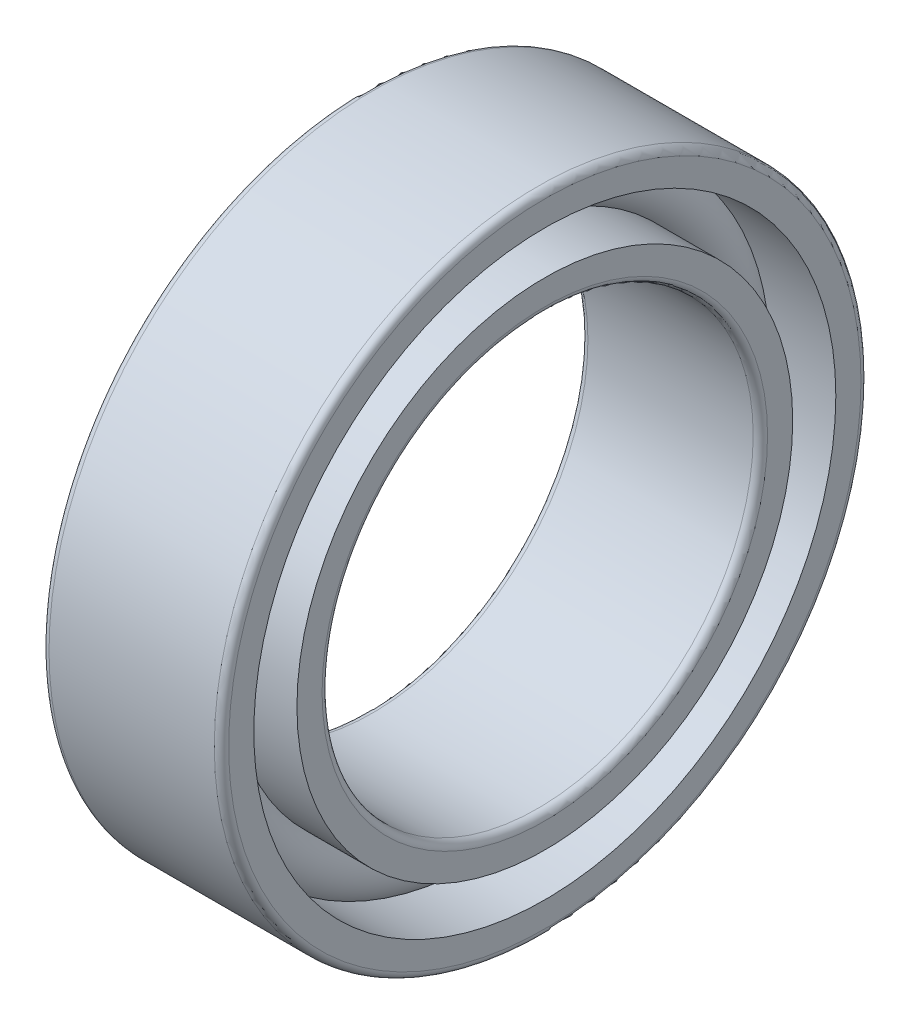
ISO-10303-21;
HEADER;
FILE_DESCRIPTION(('STEP AP214'),'2;1');
FILE_NAME('part.step','',(''),(''),'','','');
FILE_SCHEMA(('AUTOMOTIVE_DESIGN { 1 0 10303 214 1 1 1 1 }'));
ENDSEC;
DATA;
#1=APPLICATION_CONTEXT('core data for automotive mechanical design processes');
#2=APPLICATION_PROTOCOL_DEFINITION('international standard','automotive_design',2000,#1);
#3=PRODUCT_CONTEXT('',#1,'mechanical');
#4=PRODUCT('Part','Part','',(#3));
#5=PRODUCT_RELATED_PRODUCT_CATEGORY('part','',(#4));
#6=PRODUCT_DEFINITION_FORMATION('','',#4);
#7=PRODUCT_DEFINITION_CONTEXT('part definition',#1,'design');
#8=PRODUCT_DEFINITION('design','',#6,#7);
#9=PRODUCT_DEFINITION_SHAPE('','',#8);
#10=(LENGTH_UNIT() NAMED_UNIT(*) SI_UNIT(.MILLI.,.METRE.));
#11=(NAMED_UNIT(*) PLANE_ANGLE_UNIT() SI_UNIT($,.RADIAN.));
#12=(NAMED_UNIT(*) SI_UNIT($,.STERADIAN.) SOLID_ANGLE_UNIT());
#13=UNCERTAINTY_MEASURE_WITH_UNIT(LENGTH_MEASURE(1.E-05),#10,'distance_accuracy_value','');
#14=(GEOMETRIC_REPRESENTATION_CONTEXT(3) GLOBAL_UNCERTAINTY_ASSIGNED_CONTEXT((#13)) GLOBAL_UNIT_ASSIGNED_CONTEXT((#10,
#11,#12)) REPRESENTATION_CONTEXT('',''));
#15=CARTESIAN_POINT('',(0.,0.,0.));
#16=DIRECTION('',(0.,0.,1.));
#17=DIRECTION('',(1.,0.,0.));
#18=AXIS2_PLACEMENT_3D('',#15,#16,#17);
#19=CARTESIAN_POINT('',(0.,0.,0.));
#20=DIRECTION('',(-1.,0.,0.));
#21=DIRECTION('',(0.,0.,1.));
#22=AXIS2_PLACEMENT_3D('',#19,#20,#21);
#23=TOROIDAL_SURFACE('',#22,7.5,0.9);
#24=CARTESIAN_POINT('',(0.670820393249931,0.,0.));
#25=DIRECTION('',(-1.,0.,0.));
#26=DIRECTION('',(0.,0.,1.));
#27=AXIS2_PLACEMENT_3D('',#24,#25,#26);
#28=CIRCLE('',#27,8.10000000000001);
#29=CARTESIAN_POINT('',(0.670820393249931,0.,8.10000000000001));
#30=VERTEX_POINT('',#29);
#31=EDGE_CURVE('E35',#30,#30,#28,.F.);
#32=ORIENTED_EDGE('',*,*,#31,.T.);
#33=EDGE_LOOP('',(#32));
#34=FACE_BOUND('',#33,.T.);
#35=CARTESIAN_POINT('',(0.670820393249937,0.,0.));
#36=DIRECTION('',(-1.,0.,0.));
#37=DIRECTION('',(0.,0.,1.));
#38=AXIS2_PLACEMENT_3D('',#35,#36,#37);
#39=CIRCLE('',#38,6.9);
#40=CARTESIAN_POINT('',(0.670820393249937,0.,6.9));
#41=VERTEX_POINT('',#40);
#42=EDGE_CURVE('E10',#41,#41,#39,.T.);
#43=ORIENTED_EDGE('',*,*,#42,.T.);
#44=EDGE_LOOP('',(#43));
#45=FACE_BOUND('',#44,.T.);
#46=ADVANCED_FACE('F31',(#34,#45),#23,.T.);
#47=CARTESIAN_POINT('',(-20.6375,0.,0.));
#48=DIRECTION('',(1.,0.,0.));
#49=DIRECTION('',(0.,0.,-1.));
#50=AXIS2_PLACEMENT_3D('',#47,#48,#49);
#51=CYLINDRICAL_SURFACE('',#50,6.9);
#52=CARTESIAN_POINT('',(2.5,0.,0.));
#53=DIRECTION('',(1.,0.,0.));
#54=DIRECTION('',(0.,0.,-1.));
#55=AXIS2_PLACEMENT_3D('',#52,#53,#54);
#56=CIRCLE('',#55,6.9);
#57=CARTESIAN_POINT('',(2.5,0.,-6.9));
#58=VERTEX_POINT('',#57);
#59=EDGE_CURVE('E44',#58,#58,#56,.T.);
#60=ORIENTED_EDGE('',*,*,#59,.F.);
#61=EDGE_LOOP('',(#60));
#62=FACE_BOUND('',#61,.T.);
#63=ORIENTED_EDGE('',*,*,#42,.F.);
#64=EDGE_LOOP('',(#63));
#65=FACE_BOUND('',#64,.T.);
#66=ADVANCED_FACE('F83',(#62,#65),#51,.T.);
#67=CARTESIAN_POINT('',(-20.6375,0.,0.));
#68=DIRECTION('',(1.,0.,0.));
#69=DIRECTION('',(0.,0.,-1.));
#70=AXIS2_PLACEMENT_3D('',#67,#68,#69);
#71=CYLINDRICAL_SURFACE('',#70,6.9);
#72=CARTESIAN_POINT('',(-2.5,0.,0.));
#73=DIRECTION('',(1.,0.,0.));
#74=DIRECTION('',(0.,0.,-1.));
#75=AXIS2_PLACEMENT_3D('',#72,#73,#74);
#76=CIRCLE('',#75,6.9);
#77=CARTESIAN_POINT('',(-2.5,0.,-6.9));
#78=VERTEX_POINT('',#77);
#79=EDGE_CURVE('E53',#78,#78,#76,.T.);
#80=ORIENTED_EDGE('',*,*,#79,.T.);
#81=EDGE_LOOP('',(#80));
#82=FACE_BOUND('',#81,.T.);
#83=CARTESIAN_POINT('',(-0.670820393249937,0.,0.));
#84=DIRECTION('',(1.,0.,0.));
#85=DIRECTION('',(0.,0.,-1.));
#86=AXIS2_PLACEMENT_3D('',#83,#84,#85);
#87=CIRCLE('',#86,6.9);
#88=CARTESIAN_POINT('',(-0.670820393249937,0.,-6.9));
#89=VERTEX_POINT('',#88);
#90=EDGE_CURVE('E39',#89,#89,#87,.T.);
#91=ORIENTED_EDGE('',*,*,#90,.F.);
#92=EDGE_LOOP('',(#91));
#93=FACE_BOUND('',#92,.T.);
#94=ADVANCED_FACE('F86',(#82,#93),#71,.T.);
#95=CARTESIAN_POINT('',(2.5,6.2,0.));
#96=DIRECTION('',(1.,0.,0.));
#97=DIRECTION('',(0.,0.,-1.));
#98=AXIS2_PLACEMENT_3D('',#95,#96,#97);
#99=PLANE('',#98);
#100=ORIENTED_EDGE('',*,*,#59,.T.);
#101=EDGE_LOOP('',(#100));
#102=FACE_BOUND('',#101,.T.);
#103=CARTESIAN_POINT('',(2.5,0.,0.));
#104=DIRECTION('',(1.,0.,0.));
#105=DIRECTION('',(0.,0.,-1.));
#106=AXIS2_PLACEMENT_3D('',#103,#104,#105);
#107=CIRCLE('',#106,6.2);
#108=CARTESIAN_POINT('',(2.5,0.,-6.2));
#109=VERTEX_POINT('',#108);
#110=EDGE_CURVE('E75',#109,#109,#107,.T.);
#111=ORIENTED_EDGE('',*,*,#110,.F.);
#112=EDGE_LOOP('',(#111));
#113=FACE_BOUND('',#112,.T.);
#114=ADVANCED_FACE('F80',(#102,#113),#99,.T.);
#115=CARTESIAN_POINT('',(2.3,0.,0.));
#116=DIRECTION('',(1.,0.,0.));
#117=DIRECTION('',(0.,0.,-1.));
#118=AXIS2_PLACEMENT_3D('',#115,#116,#117);
#119=TOROIDAL_SURFACE('',#118,6.2,0.2);
#120=ORIENTED_EDGE('',*,*,#110,.T.);
#121=EDGE_LOOP('',(#120));
#122=FACE_BOUND('',#121,.T.);
#123=CARTESIAN_POINT('',(2.3,0.,0.));
#124=DIRECTION('',(1.,0.,0.));
#125=DIRECTION('',(0.,0.,-1.));
#126=AXIS2_PLACEMENT_3D('',#123,#124,#125);
#127=CIRCLE('',#126,6.);
#128=CARTESIAN_POINT('',(2.3,0.,-6.));
#129=VERTEX_POINT('',#128);
#130=EDGE_CURVE('E72',#129,#129,#127,.T.);
#131=ORIENTED_EDGE('',*,*,#130,.F.);
#132=EDGE_LOOP('',(#131));
#133=FACE_BOUND('',#132,.T.);
#134=ADVANCED_FACE('F97',(#122,#133),#119,.T.);
#135=CARTESIAN_POINT('',(-20.6375,0.,0.));
#136=DIRECTION('',(1.,0.,0.));
#137=DIRECTION('',(0.,0.,-1.));
#138=AXIS2_PLACEMENT_3D('',#135,#136,#137);
#139=CYLINDRICAL_SURFACE('',#138,6.);
#140=ORIENTED_EDGE('',*,*,#130,.T.);
#141=EDGE_LOOP('',(#140));
#142=FACE_BOUND('',#141,.T.);
#143=CARTESIAN_POINT('',(-2.3,0.,0.));
#144=DIRECTION('',(1.,0.,0.));
#145=DIRECTION('',(0.,0.,-1.));
#146=AXIS2_PLACEMENT_3D('',#143,#144,#145);
#147=CIRCLE('',#146,6.);
#148=CARTESIAN_POINT('',(-2.3,0.,-6.));
#149=VERTEX_POINT('',#148);
#150=EDGE_CURVE('E69',#149,#149,#147,.T.);
#151=ORIENTED_EDGE('',*,*,#150,.F.);
#152=EDGE_LOOP('',(#151));
#153=FACE_BOUND('',#152,.T.);
#154=ADVANCED_FACE('F100',(#142,#153),#139,.F.);
#155=CARTESIAN_POINT('',(-2.3,0.,0.));
#156=DIRECTION('',(1.,0.,0.));
#157=DIRECTION('',(0.,0.,-1.));
#158=AXIS2_PLACEMENT_3D('',#155,#156,#157);
#159=TOROIDAL_SURFACE('',#158,6.2,0.2);
#160=ORIENTED_EDGE('',*,*,#150,.T.);
#161=EDGE_LOOP('',(#160));
#162=FACE_BOUND('',#161,.T.);
#163=CARTESIAN_POINT('',(-2.5,0.,0.));
#164=DIRECTION('',(1.,0.,0.));
#165=DIRECTION('',(0.,0.,-1.));
#166=AXIS2_PLACEMENT_3D('',#163,#164,#165);
#167=CIRCLE('',#166,6.2);
#168=CARTESIAN_POINT('',(-2.5,0.,-6.2));
#169=VERTEX_POINT('',#168);
#170=EDGE_CURVE('E66',#169,#169,#167,.T.);
#171=ORIENTED_EDGE('',*,*,#170,.F.);
#172=EDGE_LOOP('',(#171));
#173=FACE_BOUND('',#172,.T.);
#174=ADVANCED_FACE('F104',(#162,#173),#159,.T.);
#175=CARTESIAN_POINT('',(-2.5,6.9,0.));
#176=DIRECTION('',(-1.,0.,0.));
#177=DIRECTION('',(0.,0.,1.));
#178=AXIS2_PLACEMENT_3D('',#175,#176,#177);
#179=PLANE('',#178);
#180=ORIENTED_EDGE('',*,*,#170,.T.);
#181=EDGE_LOOP('',(#180));
#182=FACE_BOUND('',#181,.T.);
#183=ORIENTED_EDGE('',*,*,#79,.F.);
#184=EDGE_LOOP('',(#183));
#185=FACE_BOUND('',#184,.T.);
#186=ADVANCED_FACE('F108',(#182,#185),#179,.T.);
#187=CARTESIAN_POINT('',(-0.670820393249931,0.,0.));
#188=DIRECTION('',(1.,0.,0.));
#189=DIRECTION('',(0.,0.,-1.));
#190=AXIS2_PLACEMENT_3D('',#187,#188,#189);
#191=CIRCLE('',#190,8.10000000000001);
#192=CARTESIAN_POINT('',(-0.670820393249931,0.,-8.10000000000001));
#193=VERTEX_POINT('',#192);
#194=EDGE_CURVE('E47',#193,#193,#191,.F.);
#195=ORIENTED_EDGE('',*,*,#194,.T.);
#196=EDGE_LOOP('',(#195));
#197=FACE_BOUND('',#196,.T.);
#198=ORIENTED_EDGE('',*,*,#90,.T.);
#199=EDGE_LOOP('',(#198));
#200=FACE_BOUND('',#199,.T.);
#201=ADVANCED_FACE('F33',(#197,#200),#23,.T.);
#202=CARTESIAN_POINT('',(-20.6375,0.,0.));
#203=DIRECTION('',(1.,0.,0.));
#204=DIRECTION('',(0.,0.,-1.));
#205=AXIS2_PLACEMENT_3D('',#202,#203,#204);
#206=CYLINDRICAL_SURFACE('',#205,8.10000000000001);
#207=CARTESIAN_POINT('',(2.5,0.,0.));
#208=DIRECTION('',(1.,0.,0.));
#209=DIRECTION('',(0.,0.,-1.));
#210=AXIS2_PLACEMENT_3D('',#207,#208,#209);
#211=CIRCLE('',#210,8.1);
#212=CARTESIAN_POINT('',(2.5,0.,-8.1));
#213=VERTEX_POINT('',#212);
#214=EDGE_CURVE('E49',#213,#213,#211,.T.);
#215=ORIENTED_EDGE('',*,*,#214,.T.);
#216=EDGE_LOOP('',(#215));
#217=FACE_BOUND('',#216,.T.);
#218=ORIENTED_EDGE('',*,*,#31,.F.);
#219=EDGE_LOOP('',(#218));
#220=FACE_BOUND('',#219,.T.);
#221=ADVANCED_FACE('F113',(#217,#220),#206,.F.);
#222=CARTESIAN_POINT('',(-20.6375,0.,0.));
#223=DIRECTION('',(1.,0.,0.));
#224=DIRECTION('',(0.,0.,-1.));
#225=AXIS2_PLACEMENT_3D('',#222,#223,#224);
#226=CYLINDRICAL_SURFACE('',#225,8.10000000000001);
#227=CARTESIAN_POINT('',(-2.5,0.,0.));
#228=DIRECTION('',(1.,0.,0.));
#229=DIRECTION('',(0.,0.,-1.));
#230=AXIS2_PLACEMENT_3D('',#227,#228,#229);
#231=CIRCLE('',#230,8.1);
#232=CARTESIAN_POINT('',(-2.5,0.,-8.1));
#233=VERTEX_POINT('',#232);
#234=EDGE_CURVE('E144',#233,#233,#231,.T.);
#235=ORIENTED_EDGE('',*,*,#234,.F.);
#236=EDGE_LOOP('',(#235));
#237=FACE_BOUND('',#236,.T.);
#238=ORIENTED_EDGE('',*,*,#194,.F.);
#239=EDGE_LOOP('',(#238));
#240=FACE_BOUND('',#239,.T.);
#241=ADVANCED_FACE('F116',(#237,#240),#226,.F.);
#242=CARTESIAN_POINT('',(2.5,8.8,0.));
#243=DIRECTION('',(1.,0.,0.));
#244=DIRECTION('',(0.,0.,-1.));
#245=AXIS2_PLACEMENT_3D('',#242,#243,#244);
#246=PLANE('',#245);
#247=CARTESIAN_POINT('',(2.5,0.,0.));
#248=DIRECTION('',(1.,0.,0.));
#249=DIRECTION('',(0.,0.,-1.));
#250=AXIS2_PLACEMENT_3D('',#247,#248,#249);
#251=CIRCLE('',#250,8.8);
#252=CARTESIAN_POINT('',(2.5,0.,-8.8));
#253=VERTEX_POINT('',#252);
#254=EDGE_CURVE('E55',#253,#253,#251,.T.);
#255=ORIENTED_EDGE('',*,*,#254,.T.);
#256=EDGE_LOOP('',(#255));
#257=FACE_BOUND('',#256,.T.);
#258=ORIENTED_EDGE('',*,*,#214,.F.);
#259=EDGE_LOOP('',(#258));
#260=FACE_BOUND('',#259,.T.);
#261=ADVANCED_FACE('F117',(#257,#260),#246,.T.);
#262=CARTESIAN_POINT('',(2.3,0.,0.));
#263=DIRECTION('',(1.,0.,0.));
#264=DIRECTION('',(0.,0.,-1.));
#265=AXIS2_PLACEMENT_3D('',#262,#263,#264);
#266=TOROIDAL_SURFACE('',#265,8.8,0.2);
#267=CARTESIAN_POINT('',(2.3,0.,0.));
#268=DIRECTION('',(1.,0.,0.));
#269=DIRECTION('',(0.,0.,-1.));
#270=AXIS2_PLACEMENT_3D('',#267,#268,#269);
#271=CIRCLE('',#270,9.);
#272=CARTESIAN_POINT('',(2.3,0.,-9.));
#273=VERTEX_POINT('',#272);
#274=EDGE_CURVE('E60',#273,#273,#271,.T.);
#275=ORIENTED_EDGE('',*,*,#274,.T.);
#276=EDGE_LOOP('',(#275));
#277=FACE_BOUND('',#276,.T.);
#278=ORIENTED_EDGE('',*,*,#254,.F.);
#279=EDGE_LOOP('',(#278));
#280=FACE_BOUND('',#279,.T.);
#281=ADVANCED_FACE('F120',(#277,#280),#266,.T.);
#282=CARTESIAN_POINT('',(-20.6375,0.,0.));
#283=DIRECTION('',(1.,0.,0.));
#284=DIRECTION('',(0.,0.,-1.));
#285=AXIS2_PLACEMENT_3D('',#282,#283,#284);
#286=CYLINDRICAL_SURFACE('',#285,9.);
#287=CARTESIAN_POINT('',(-2.3,0.,0.));
#288=DIRECTION('',(1.,0.,0.));
#289=DIRECTION('',(0.,0.,-1.));
#290=AXIS2_PLACEMENT_3D('',#287,#288,#289);
#291=CIRCLE('',#290,9.);
#292=CARTESIAN_POINT('',(-2.3,0.,-9.));
#293=VERTEX_POINT('',#292);
#294=EDGE_CURVE('E148',#293,#293,#291,.T.);
#295=ORIENTED_EDGE('',*,*,#294,.T.);
#296=EDGE_LOOP('',(#295));
#297=FACE_BOUND('',#296,.T.);
#298=ORIENTED_EDGE('',*,*,#274,.F.);
#299=EDGE_LOOP('',(#298));
#300=FACE_BOUND('',#299,.T.);
#301=ADVANCED_FACE('F124',(#297,#300),#286,.T.);
#302=CARTESIAN_POINT('',(-2.3,0.,0.));
#303=DIRECTION('',(1.,0.,0.));
#304=DIRECTION('',(0.,0.,-1.));
#305=AXIS2_PLACEMENT_3D('',#302,#303,#304);
#306=TOROIDAL_SURFACE('',#305,8.8,0.2);
#307=CARTESIAN_POINT('',(-2.5,0.,0.));
#308=DIRECTION('',(1.,0.,0.));
#309=DIRECTION('',(0.,0.,-1.));
#310=AXIS2_PLACEMENT_3D('',#307,#308,#309);
#311=CIRCLE('',#310,8.8);
#312=CARTESIAN_POINT('',(-2.5,0.,-8.8));
#313=VERTEX_POINT('',#312);
#314=EDGE_CURVE('E145',#313,#313,#311,.T.);
#315=ORIENTED_EDGE('',*,*,#314,.T.);
#316=EDGE_LOOP('',(#315));
#317=FACE_BOUND('',#316,.T.);
#318=ORIENTED_EDGE('',*,*,#294,.F.);
#319=EDGE_LOOP('',(#318));
#320=FACE_BOUND('',#319,.T.);
#321=ADVANCED_FACE('F128',(#317,#320),#306,.T.);
#322=CARTESIAN_POINT('',(-2.5,8.1,0.));
#323=DIRECTION('',(-1.,0.,0.));
#324=DIRECTION('',(0.,0.,1.));
#325=AXIS2_PLACEMENT_3D('',#322,#323,#324);
#326=PLANE('',#325);
#327=ORIENTED_EDGE('',*,*,#234,.T.);
#328=EDGE_LOOP('',(#327));
#329=FACE_BOUND('',#328,.T.);
#330=ORIENTED_EDGE('',*,*,#314,.F.);
#331=EDGE_LOOP('',(#330));
#332=FACE_BOUND('',#331,.T.);
#333=ADVANCED_FACE('F132',(#329,#332),#326,.T.);
#334=CLOSED_SHELL('',(#46,#66,#94,#114,#134,#154,#174,#186,#201,#221,#241,#261,#281,#301,#321,#333));
#335=MANIFOLD_SOLID_BREP('B2',#334);
#336=ADVANCED_BREP_SHAPE_REPRESENTATION('',(#18,#335),#14);
#337=SHAPE_DEFINITION_REPRESENTATION(#9,#336);
ENDSEC;
END-ISO-10303-21;
